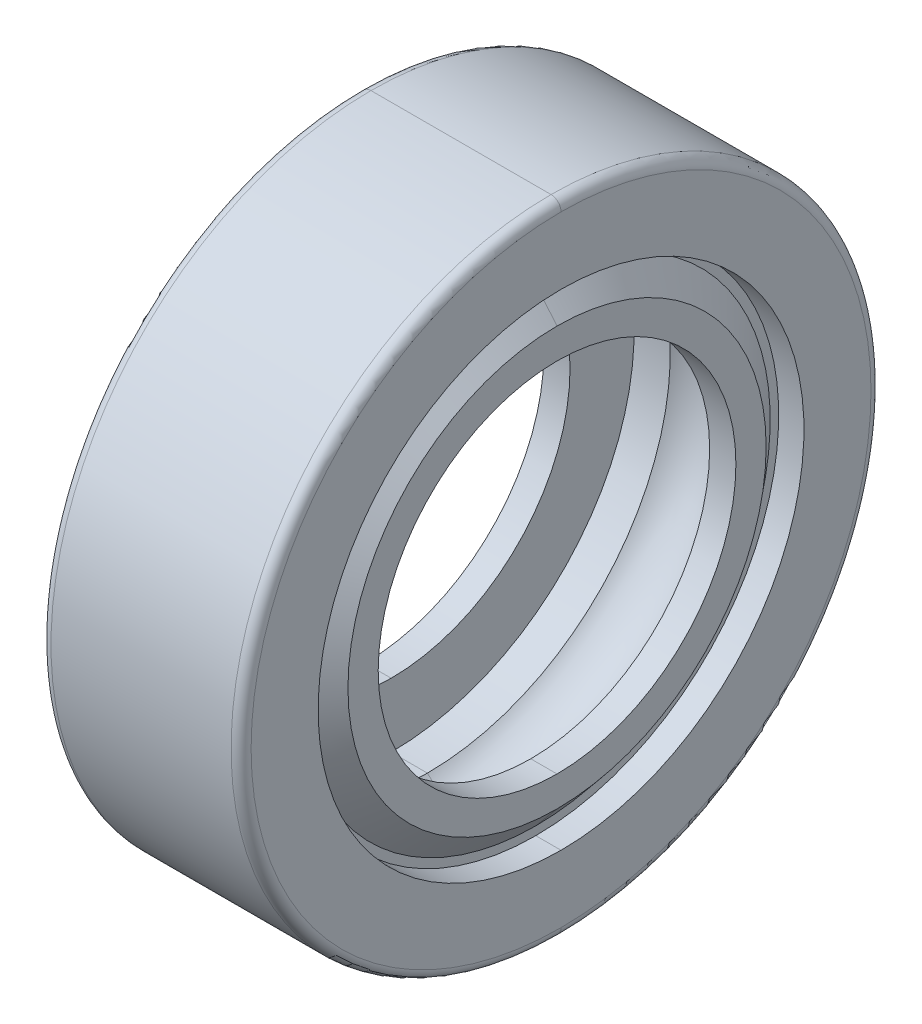
ISO-10303-21;
HEADER;
FILE_DESCRIPTION(('STEP AP214'),'2;1');
FILE_NAME('part.step','',(''),(''),'','','');
FILE_SCHEMA(('AUTOMOTIVE_DESIGN { 1 0 10303 214 1 1 1 1 }'));
ENDSEC;
DATA;
#1=APPLICATION_CONTEXT('core data for automotive mechanical design processes');
#2=APPLICATION_PROTOCOL_DEFINITION('international standard','automotive_design',2000,#1);
#3=PRODUCT_CONTEXT('',#1,'mechanical');
#4=PRODUCT('Part','Part','',(#3));
#5=PRODUCT_RELATED_PRODUCT_CATEGORY('part','',(#4));
#6=PRODUCT_DEFINITION_FORMATION('','',#4);
#7=PRODUCT_DEFINITION_CONTEXT('part definition',#1,'design');
#8=PRODUCT_DEFINITION('design','',#6,#7);
#9=PRODUCT_DEFINITION_SHAPE('','',#8);
#10=(LENGTH_UNIT() NAMED_UNIT(*) SI_UNIT(.MILLI.,.METRE.));
#11=(NAMED_UNIT(*) PLANE_ANGLE_UNIT() SI_UNIT($,.RADIAN.));
#12=(NAMED_UNIT(*) SI_UNIT($,.STERADIAN.) SOLID_ANGLE_UNIT());
#13=UNCERTAINTY_MEASURE_WITH_UNIT(LENGTH_MEASURE(1.E-05),#10,'distance_accuracy_value','');
#14=(GEOMETRIC_REPRESENTATION_CONTEXT(3) GLOBAL_UNCERTAINTY_ASSIGNED_CONTEXT((#13)) GLOBAL_UNIT_ASSIGNED_CONTEXT((#10,
#11,#12)) REPRESENTATION_CONTEXT('',''));
#15=CARTESIAN_POINT('',(0.,0.,0.));
#16=DIRECTION('',(0.,0.,1.));
#17=DIRECTION('',(1.,0.,0.));
#18=AXIS2_PLACEMENT_3D('',#15,#16,#17);
#19=CARTESIAN_POINT('',(-1.87059655427954,0.,0.));
#20=DIRECTION('',(1.,0.,0.));
#21=DIRECTION('',(0.,1.,0.));
#22=AXIS2_PLACEMENT_3D('',#19,#20,#21);
#23=PLANE('',#22);
#24=CARTESIAN_POINT('',(-1.87059655427954,0.,0.));
#25=DIRECTION('',(-1.,0.,0.));
#26=DIRECTION('',(0.,1.,0.));
#27=AXIS2_PLACEMENT_3D('',#24,#25,#26);
#28=CIRCLE('',#27,5.8619649715);
#29=CARTESIAN_POINT('',(-1.87059655427954,5.8619649715,0.));
#30=VERTEX_POINT('',#29);
#31=CARTESIAN_POINT('',(-1.87059655427954,-5.8619649715,0.));
#32=VERTEX_POINT('',#31);
#33=EDGE_CURVE('E357',#30,#32,#28,.T.);
#34=ORIENTED_EDGE('',*,*,#33,.F.);
#35=CARTESIAN_POINT('',(-1.87059655427954,0.,0.));
#36=DIRECTION('',(1.,0.,0.));
#37=DIRECTION('',(0.,1.,0.));
#38=AXIS2_PLACEMENT_3D('',#35,#36,#37);
#39=CIRCLE('',#38,5.8619649715);
#40=EDGE_CURVE('E307',#30,#32,#39,.T.);
#41=ORIENTED_EDGE('',*,*,#40,.T.);
#42=EDGE_LOOP('',(#34,#41));
#43=FACE_BOUND('',#42,.T.);
#44=CARTESIAN_POINT('',(-1.87059655427954,0.,0.));
#45=DIRECTION('',(1.,0.,0.));
#46=DIRECTION('',(0.,-1.,0.));
#47=AXIS2_PLACEMENT_3D('',#44,#45,#46);
#48=CIRCLE('',#47,6.0745751);
#49=CARTESIAN_POINT('',(-1.87059655427954,-6.0745751,0.));
#50=VERTEX_POINT('',#49);
#51=CARTESIAN_POINT('',(-1.87059655427954,6.0745751,0.));
#52=VERTEX_POINT('',#51);
#53=EDGE_CURVE('E27',#50,#52,#48,.T.);
#54=ORIENTED_EDGE('',*,*,#53,.F.);
#55=CARTESIAN_POINT('',(-1.87059655427954,0.,0.));
#56=DIRECTION('',(1.,0.,0.));
#57=DIRECTION('',(0.,1.,0.));
#58=AXIS2_PLACEMENT_3D('',#55,#56,#57);
#59=CIRCLE('',#58,6.0745751);
#60=EDGE_CURVE('E11',#52,#50,#59,.T.);
#61=ORIENTED_EDGE('',*,*,#60,.F.);
#62=EDGE_LOOP('',(#54,#61));
#63=FACE_BOUND('',#62,.T.);
#64=ADVANCED_FACE('F16',(#43,#63),#23,.F.);
#65=CARTESIAN_POINT('',(-2.75209,0.,0.));
#66=DIRECTION('',(1.,0.,0.));
#67=DIRECTION('',(0.,-1.,0.));
#68=AXIS2_PLACEMENT_3D('',#65,#66,#67);
#69=CYLINDRICAL_SURFACE('',#68,6.0745751);
#70=DIRECTION('',(1.,0.,0.));
#71=VECTOR('',#70,1.);
#72=CARTESIAN_POINT('',(-2.5019,-6.0745751,0.));
#73=LINE('',#72,#71);
#74=CARTESIAN_POINT('',(-2.5019,-6.0745751,0.));
#75=VERTEX_POINT('',#74);
#76=EDGE_CURVE('E133',#75,#50,#73,.T.);
#77=ORIENTED_EDGE('',*,*,#76,.F.);
#78=CARTESIAN_POINT('',(-2.5019,0.,0.));
#79=DIRECTION('',(1.,0.,0.));
#80=DIRECTION('',(0.,1.,0.));
#81=AXIS2_PLACEMENT_3D('',#78,#79,#80);
#82=CIRCLE('',#81,6.0745751);
#83=CARTESIAN_POINT('',(-2.5019,6.0745751,0.));
#84=VERTEX_POINT('',#83);
#85=EDGE_CURVE('E348',#84,#75,#82,.T.);
#86=ORIENTED_EDGE('',*,*,#85,.F.);
#87=DIRECTION('',(1.,0.,0.));
#88=VECTOR('',#87,1.);
#89=CARTESIAN_POINT('',(-2.5019,6.0745751,0.));
#90=LINE('',#89,#88);
#91=EDGE_CURVE('E146',#84,#52,#90,.T.);
#92=ORIENTED_EDGE('',*,*,#91,.T.);
#93=ORIENTED_EDGE('',*,*,#60,.T.);
#94=EDGE_LOOP('',(#77,#86,#92,#93));
#95=FACE_BOUND('',#94,.T.);
#96=ADVANCED_FACE('F477',(#95),#69,.F.);
#97=CARTESIAN_POINT('',(-2.75209,0.,0.));
#98=DIRECTION('',(1.,0.,0.));
#99=DIRECTION('',(0.,-1.,0.));
#100=AXIS2_PLACEMENT_3D('',#97,#98,#99);
#101=CYLINDRICAL_SURFACE('',#100,6.0745751);
#102=ORIENTED_EDGE('',*,*,#91,.F.);
#103=CARTESIAN_POINT('',(-2.5019,0.,0.));
#104=DIRECTION('',(-1.,0.,0.));
#105=DIRECTION('',(0.,1.,0.));
#106=AXIS2_PLACEMENT_3D('',#103,#104,#105);
#107=CIRCLE('',#106,6.0745751);
#108=EDGE_CURVE('E261',#84,#75,#107,.T.);
#109=ORIENTED_EDGE('',*,*,#108,.T.);
#110=ORIENTED_EDGE('',*,*,#76,.T.);
#111=ORIENTED_EDGE('',*,*,#53,.T.);
#112=EDGE_LOOP('',(#102,#109,#110,#111));
#113=FACE_BOUND('',#112,.T.);
#114=ADVANCED_FACE('F18',(#113),#101,.F.);
#115=CARTESIAN_POINT('',(-2.5019,0.,0.));
#116=DIRECTION('',(1.,0.,0.));
#117=DIRECTION('',(0.,1.,0.));
#118=AXIS2_PLACEMENT_3D('',#115,#116,#117);
#119=PLANE('',#118);
#120=ORIENTED_EDGE('',*,*,#108,.F.);
#121=ORIENTED_EDGE('',*,*,#85,.T.);
#122=EDGE_LOOP('',(#120,#121));
#123=FACE_BOUND('',#122,.T.);
#124=CARTESIAN_POINT('',(-2.5019,0.,0.));
#125=DIRECTION('',(1.,0.,0.));
#126=DIRECTION('',(0.,1.,0.));
#127=AXIS2_PLACEMENT_3D('',#124,#125,#126);
#128=CIRCLE('',#127,7.75081);
#129=CARTESIAN_POINT('',(-2.5019,7.75081,0.));
#130=VERTEX_POINT('',#129);
#131=CARTESIAN_POINT('',(-2.5019,-7.75081,0.));
#132=VERTEX_POINT('',#131);
#133=EDGE_CURVE('E256',#130,#132,#128,.T.);
#134=ORIENTED_EDGE('',*,*,#133,.F.);
#135=CARTESIAN_POINT('',(-2.5019,0.,0.));
#136=DIRECTION('',(-1.,0.,0.));
#137=DIRECTION('',(0.,1.,0.));
#138=AXIS2_PLACEMENT_3D('',#135,#136,#137);
#139=CIRCLE('',#138,7.75081);
#140=EDGE_CURVE('E258',#130,#132,#139,.T.);
#141=ORIENTED_EDGE('',*,*,#140,.T.);
#142=EDGE_LOOP('',(#134,#141));
#143=FACE_BOUND('',#142,.T.);
#144=ADVANCED_FACE('F562',(#123,#143),#119,.F.);
#145=CARTESIAN_POINT('',(-2.25171,0.,0.));
#146=DIRECTION('',(1.,0.,0.));
#147=DIRECTION('',(0.,-1.,0.));
#148=AXIS2_PLACEMENT_3D('',#145,#146,#147);
#149=TOROIDAL_SURFACE('',#148,7.75081,0.25019);
#150=CARTESIAN_POINT('',(-2.25171,0.,0.));
#151=DIRECTION('',(-1.,0.,0.));
#152=DIRECTION('',(0.,1.,0.));
#153=AXIS2_PLACEMENT_3D('',#150,#151,#152);
#154=CIRCLE('',#153,8.001);
#155=CARTESIAN_POINT('',(-2.25171,8.001,0.));
#156=VERTEX_POINT('',#155);
#157=CARTESIAN_POINT('',(-2.25171,-8.001,0.));
#158=VERTEX_POINT('',#157);
#159=EDGE_CURVE('E291',#156,#158,#154,.T.);
#160=ORIENTED_EDGE('',*,*,#159,.T.);
#161=CARTESIAN_POINT('',(-2.25171,-7.75081,0.));
#162=DIRECTION('',(0.,0.,-1.));
#163=DIRECTION('',(0.,-1.,0.));
#164=AXIS2_PLACEMENT_3D('',#161,#162,#163);
#165=CIRCLE('',#164,0.25019);
#166=EDGE_CURVE('E349',#158,#132,#165,.T.);
#167=ORIENTED_EDGE('',*,*,#166,.T.);
#168=ORIENTED_EDGE('',*,*,#140,.F.);
#169=CARTESIAN_POINT('',(-2.25171,7.75081,0.));
#170=DIRECTION('',(0.,0.,1.));
#171=DIRECTION('',(0.,1.,0.));
#172=AXIS2_PLACEMENT_3D('',#169,#170,#171);
#173=CIRCLE('',#172,0.25019);
#174=EDGE_CURVE('E262',#156,#130,#173,.T.);
#175=ORIENTED_EDGE('',*,*,#174,.F.);
#176=EDGE_LOOP('',(#160,#167,#168,#175));
#177=FACE_BOUND('',#176,.T.);
#178=ADVANCED_FACE('F531',(#177),#149,.T.);
#179=CARTESIAN_POINT('',(-2.25171,0.,0.));
#180=DIRECTION('',(1.,0.,0.));
#181=DIRECTION('',(0.,-1.,0.));
#182=AXIS2_PLACEMENT_3D('',#179,#180,#181);
#183=TOROIDAL_SURFACE('',#182,7.75081,0.25019);
#184=ORIENTED_EDGE('',*,*,#133,.T.);
#185=ORIENTED_EDGE('',*,*,#166,.F.);
#186=CARTESIAN_POINT('',(-2.25171,0.,0.));
#187=DIRECTION('',(1.,0.,0.));
#188=DIRECTION('',(0.,1.,0.));
#189=AXIS2_PLACEMENT_3D('',#186,#187,#188);
#190=CIRCLE('',#189,8.001);
#191=EDGE_CURVE('E252',#156,#158,#190,.T.);
#192=ORIENTED_EDGE('',*,*,#191,.F.);
#193=ORIENTED_EDGE('',*,*,#174,.T.);
#194=EDGE_LOOP('',(#184,#185,#192,#193));
#195=FACE_BOUND('',#194,.T.);
#196=ADVANCED_FACE('F526',(#195),#183,.T.);
#197=CARTESIAN_POINT('',(-2.75209,0.,0.));
#198=DIRECTION('',(1.,0.,0.));
#199=DIRECTION('',(0.,-1.,0.));
#200=AXIS2_PLACEMENT_3D('',#197,#198,#199);
#201=CYLINDRICAL_SURFACE('',#200,8.001);
#202=ORIENTED_EDGE('',*,*,#191,.T.);
#203=DIRECTION('',(-1.,0.,0.));
#204=VECTOR('',#203,1.);
#205=CARTESIAN_POINT('',(2.25171,-8.001,0.));
#206=LINE('',#205,#204);
#207=CARTESIAN_POINT('',(2.25171,-8.001,0.));
#208=VERTEX_POINT('',#207);
#209=EDGE_CURVE('E295',#208,#158,#206,.T.);
#210=ORIENTED_EDGE('',*,*,#209,.F.);
#211=CARTESIAN_POINT('',(2.25171,0.,0.));
#212=DIRECTION('',(1.,0.,0.));
#213=DIRECTION('',(0.,1.,0.));
#214=AXIS2_PLACEMENT_3D('',#211,#212,#213);
#215=CIRCLE('',#214,8.001);
#216=CARTESIAN_POINT('',(2.25171,8.001,0.));
#217=VERTEX_POINT('',#216);
#218=EDGE_CURVE('E274',#217,#208,#215,.T.);
#219=ORIENTED_EDGE('',*,*,#218,.F.);
#220=DIRECTION('',(-1.,0.,0.));
#221=VECTOR('',#220,1.);
#222=CARTESIAN_POINT('',(2.25171,8.001,0.));
#223=LINE('',#222,#221);
#224=EDGE_CURVE('E257',#217,#156,#223,.T.);
#225=ORIENTED_EDGE('',*,*,#224,.T.);
#226=EDGE_LOOP('',(#202,#210,#219,#225));
#227=FACE_BOUND('',#226,.T.);
#228=ADVANCED_FACE('F495',(#227),#201,.T.);
#229=CARTESIAN_POINT('',(-2.75209,0.,0.));
#230=DIRECTION('',(1.,0.,0.));
#231=DIRECTION('',(0.,-1.,0.));
#232=AXIS2_PLACEMENT_3D('',#229,#230,#231);
#233=CYLINDRICAL_SURFACE('',#232,8.001);
#234=CARTESIAN_POINT('',(2.25171,0.,0.));
#235=DIRECTION('',(-1.,0.,0.));
#236=DIRECTION('',(0.,1.,0.));
#237=AXIS2_PLACEMENT_3D('',#234,#235,#236);
#238=CIRCLE('',#237,8.001);
#239=EDGE_CURVE('E315',#217,#208,#238,.T.);
#240=ORIENTED_EDGE('',*,*,#239,.T.);
#241=ORIENTED_EDGE('',*,*,#209,.T.);
#242=ORIENTED_EDGE('',*,*,#159,.F.);
#243=ORIENTED_EDGE('',*,*,#224,.F.);
#244=EDGE_LOOP('',(#240,#241,#242,#243));
#245=FACE_BOUND('',#244,.T.);
#246=ADVANCED_FACE('F491',(#245),#233,.T.);
#247=CARTESIAN_POINT('',(2.25171,0.,0.));
#248=DIRECTION('',(1.,0.,0.));
#249=DIRECTION('',(0.,-1.,0.));
#250=AXIS2_PLACEMENT_3D('',#247,#248,#249);
#251=TOROIDAL_SURFACE('',#250,7.75081,0.25019);
#252=CARTESIAN_POINT('',(2.5019,0.,0.));
#253=DIRECTION('',(-1.,0.,0.));
#254=DIRECTION('',(0.,1.,0.));
#255=AXIS2_PLACEMENT_3D('',#252,#253,#254);
#256=CIRCLE('',#255,7.75081);
#257=CARTESIAN_POINT('',(2.5019,7.75081,0.));
#258=VERTEX_POINT('',#257);
#259=CARTESIAN_POINT('',(2.5019,-7.75081,0.));
#260=VERTEX_POINT('',#259);
#261=EDGE_CURVE('E323',#258,#260,#256,.T.);
#262=ORIENTED_EDGE('',*,*,#261,.T.);
#263=CARTESIAN_POINT('',(2.25171,-7.75081,0.));
#264=DIRECTION('',(0.,0.,-1.));
#265=DIRECTION('',(1.,0.,0.));
#266=AXIS2_PLACEMENT_3D('',#263,#264,#265);
#267=CIRCLE('',#266,0.25019);
#268=EDGE_CURVE('E278',#260,#208,#267,.T.);
#269=ORIENTED_EDGE('',*,*,#268,.T.);
#270=ORIENTED_EDGE('',*,*,#239,.F.);
#271=CARTESIAN_POINT('',(2.25171,7.75081,0.));
#272=DIRECTION('',(0.,0.,1.));
#273=DIRECTION('',(1.,0.,0.));
#274=AXIS2_PLACEMENT_3D('',#271,#272,#273);
#275=CIRCLE('',#274,0.25019);
#276=EDGE_CURVE('E336',#258,#217,#275,.T.);
#277=ORIENTED_EDGE('',*,*,#276,.F.);
#278=EDGE_LOOP('',(#262,#269,#270,#277));
#279=FACE_BOUND('',#278,.T.);
#280=ADVANCED_FACE('F494',(#279),#251,.T.);
#281=CARTESIAN_POINT('',(2.25171,0.,0.));
#282=DIRECTION('',(1.,0.,0.));
#283=DIRECTION('',(0.,-1.,0.));
#284=AXIS2_PLACEMENT_3D('',#281,#282,#283);
#285=TOROIDAL_SURFACE('',#284,7.75081,0.25019);
#286=ORIENTED_EDGE('',*,*,#218,.T.);
#287=ORIENTED_EDGE('',*,*,#268,.F.);
#288=CARTESIAN_POINT('',(2.5019,0.,0.));
#289=DIRECTION('',(1.,0.,0.));
#290=DIRECTION('',(0.,1.,0.));
#291=AXIS2_PLACEMENT_3D('',#288,#289,#290);
#292=CIRCLE('',#291,7.75081);
#293=EDGE_CURVE('E279',#258,#260,#292,.T.);
#294=ORIENTED_EDGE('',*,*,#293,.F.);
#295=ORIENTED_EDGE('',*,*,#276,.T.);
#296=EDGE_LOOP('',(#286,#287,#294,#295));
#297=FACE_BOUND('',#296,.T.);
#298=ADVANCED_FACE('F508',(#297),#285,.T.);
#299=CARTESIAN_POINT('',(2.5019,0.,0.));
#300=DIRECTION('',(1.,0.,0.));
#301=DIRECTION('',(0.,1.,0.));
#302=AXIS2_PLACEMENT_3D('',#299,#300,#301);
#303=PLANE('',#302);
#304=CARTESIAN_POINT('',(2.5019,0.,0.));
#305=DIRECTION('',(1.,0.,0.));
#306=DIRECTION('',(0.,1.,0.));
#307=AXIS2_PLACEMENT_3D('',#304,#305,#306);
#308=CIRCLE('',#307,6.0745751);
#309=CARTESIAN_POINT('',(2.5019,6.0745751,0.));
#310=VERTEX_POINT('',#309);
#311=CARTESIAN_POINT('',(2.5019,-6.0745751,0.));
#312=VERTEX_POINT('',#311);
#313=EDGE_CURVE('E288',#310,#312,#308,.T.);
#314=ORIENTED_EDGE('',*,*,#313,.F.);
#315=CARTESIAN_POINT('',(2.5019,0.,0.));
#316=DIRECTION('',(-1.,0.,0.));
#317=DIRECTION('',(0.,1.,0.));
#318=AXIS2_PLACEMENT_3D('',#315,#316,#317);
#319=CIRCLE('',#318,6.0745751);
#320=EDGE_CURVE('E250',#310,#312,#319,.T.);
#321=ORIENTED_EDGE('',*,*,#320,.T.);
#322=EDGE_LOOP('',(#314,#321));
#323=FACE_BOUND('',#322,.T.);
#324=ORIENTED_EDGE('',*,*,#261,.F.);
#325=ORIENTED_EDGE('',*,*,#293,.T.);
#326=EDGE_LOOP('',(#324,#325));
#327=FACE_BOUND('',#326,.T.);
#328=ADVANCED_FACE('F512',(#323,#327),#303,.T.);
#329=CARTESIAN_POINT('',(-2.75209,0.,0.));
#330=DIRECTION('',(1.,0.,0.));
#331=DIRECTION('',(0.,-1.,0.));
#332=AXIS2_PLACEMENT_3D('',#329,#330,#331);
#333=CYLINDRICAL_SURFACE('',#332,6.0745751);
#334=DIRECTION('',(1.,0.,0.));
#335=VECTOR('',#334,1.);
#336=CARTESIAN_POINT('',(1.87059655427954,-6.0745751,0.));
#337=LINE('',#336,#335);
#338=CARTESIAN_POINT('',(1.87059655427954,-6.0745751,0.));
#339=VERTEX_POINT('',#338);
#340=EDGE_CURVE('E386',#339,#312,#337,.T.);
#341=ORIENTED_EDGE('',*,*,#340,.T.);
#342=ORIENTED_EDGE('',*,*,#320,.F.);
#343=DIRECTION('',(1.,0.,0.));
#344=VECTOR('',#343,1.);
#345=CARTESIAN_POINT('',(1.87059655427954,6.0745751,0.));
#346=LINE('',#345,#344);
#347=CARTESIAN_POINT('',(1.87059655427954,6.0745751,0.));
#348=VERTEX_POINT('',#347);
#349=EDGE_CURVE('E285',#348,#310,#346,.T.);
#350=ORIENTED_EDGE('',*,*,#349,.F.);
#351=CARTESIAN_POINT('',(1.87059655427954,0.,0.));
#352=DIRECTION('',(1.,0.,0.));
#353=DIRECTION('',(0.,-1.,0.));
#354=AXIS2_PLACEMENT_3D('',#351,#352,#353);
#355=CIRCLE('',#354,6.0745751);
#356=EDGE_CURVE('E247',#339,#348,#355,.T.);
#357=ORIENTED_EDGE('',*,*,#356,.F.);
#358=EDGE_LOOP('',(#341,#342,#350,#357));
#359=FACE_BOUND('',#358,.T.);
#360=ADVANCED_FACE('F590',(#359),#333,.F.);
#361=CARTESIAN_POINT('',(1.87059655427954,0.,0.));
#362=DIRECTION('',(1.,0.,0.));
#363=DIRECTION('',(0.,1.,0.));
#364=AXIS2_PLACEMENT_3D('',#361,#362,#363);
#365=PLANE('',#364);
#366=CARTESIAN_POINT('',(1.87059655427954,0.,0.));
#367=DIRECTION('',(1.,0.,0.));
#368=DIRECTION('',(0.,1.,0.));
#369=AXIS2_PLACEMENT_3D('',#366,#367,#368);
#370=CIRCLE('',#369,5.8619649715);
#371=CARTESIAN_POINT('',(1.87059655427954,5.8619649715,0.));
#372=VERTEX_POINT('',#371);
#373=CARTESIAN_POINT('',(1.87059655427954,-5.8619649715,0.));
#374=VERTEX_POINT('',#373);
#375=EDGE_CURVE('E20',#372,#374,#370,.T.);
#376=ORIENTED_EDGE('',*,*,#375,.F.);
#377=CARTESIAN_POINT('',(1.87059655427954,0.,0.));
#378=DIRECTION('',(-1.,0.,0.));
#379=DIRECTION('',(0.,1.,0.));
#380=AXIS2_PLACEMENT_3D('',#377,#378,#379);
#381=CIRCLE('',#380,5.8619649715);
#382=EDGE_CURVE('E289',#372,#374,#381,.T.);
#383=ORIENTED_EDGE('',*,*,#382,.T.);
#384=EDGE_LOOP('',(#376,#383));
#385=FACE_BOUND('',#384,.T.);
#386=ORIENTED_EDGE('',*,*,#356,.T.);
#387=CARTESIAN_POINT('',(1.87059655427954,0.,0.));
#388=DIRECTION('',(1.,0.,0.));
#389=DIRECTION('',(0.,1.,0.));
#390=AXIS2_PLACEMENT_3D('',#387,#388,#389);
#391=CIRCLE('',#390,6.0745751);
#392=EDGE_CURVE('E251',#348,#339,#391,.T.);
#393=ORIENTED_EDGE('',*,*,#392,.T.);
#394=EDGE_LOOP('',(#386,#393));
#395=FACE_BOUND('',#394,.T.);
#396=ADVANCED_FACE('F450',(#385,#395),#365,.T.);
#397=CARTESIAN_POINT('',(-2.75209,0.,0.));
#398=DIRECTION('',(1.,0.,0.));
#399=DIRECTION('',(0.,-1.,0.));
#400=AXIS2_PLACEMENT_3D('',#397,#398,#399);
#401=CYLINDRICAL_SURFACE('',#400,6.0745751);
#402=ORIENTED_EDGE('',*,*,#349,.T.);
#403=ORIENTED_EDGE('',*,*,#313,.T.);
#404=ORIENTED_EDGE('',*,*,#340,.F.);
#405=ORIENTED_EDGE('',*,*,#392,.F.);
#406=EDGE_LOOP('',(#402,#403,#404,#405));
#407=FACE_BOUND('',#406,.T.);
#408=ADVANCED_FACE('F490',(#407),#401,.F.);
#409=CARTESIAN_POINT('',(2.41970134453178,0.,0.));
#410=DIRECTION('',(-1.,0.,0.));
#411=DIRECTION('',(0.,1.,0.));
#412=AXIS2_PLACEMENT_3D('',#409,#410,#411);
#413=CONICAL_SURFACE('',#412,5.20756736500621,0.872664625997165);
#414=CARTESIAN_POINT('',(2.401824,0.,0.));
#415=DIRECTION('',(-1.,0.,0.));
#416=DIRECTION('',(0.,1.,0.));
#417=AXIS2_PLACEMENT_3D('',#414,#415,#416);
#418=CIRCLE('',#417,5.228872754578);
#419=CARTESIAN_POINT('',(2.401824,5.228872754578,0.));
#420=VERTEX_POINT('',#419);
#421=CARTESIAN_POINT('',(2.401824,-5.228872754578,0.));
#422=VERTEX_POINT('',#421);
#423=EDGE_CURVE('E224',#420,#422,#418,.T.);
#424=ORIENTED_EDGE('',*,*,#423,.T.);
#425=DIRECTION('',(-0.642787609686539,-0.766044443118978,0.));
#426=VECTOR('',#425,1.);
#427=CARTESIAN_POINT('',(2.401824,-5.228872754578,0.));
#428=LINE('',#427,#426);
#429=EDGE_CURVE('E317',#422,#374,#428,.T.);
#430=ORIENTED_EDGE('',*,*,#429,.T.);
#431=ORIENTED_EDGE('',*,*,#382,.F.);
#432=DIRECTION('',(-0.642787609686539,0.766044443118978,0.));
#433=VECTOR('',#432,1.);
#434=CARTESIAN_POINT('',(2.401824,5.228872754578,0.));
#435=LINE('',#434,#433);
#436=EDGE_CURVE('E321',#420,#372,#435,.T.);
#437=ORIENTED_EDGE('',*,*,#436,.F.);
#438=EDGE_LOOP('',(#424,#430,#431,#437));
#439=FACE_BOUND('',#438,.T.);
#440=ADVANCED_FACE('F454',(#439),#413,.T.);
#441=CARTESIAN_POINT('',(2.41970134453178,0.,0.));
#442=DIRECTION('',(-1.,0.,0.));
#443=DIRECTION('',(0.,1.,0.));
#444=AXIS2_PLACEMENT_3D('',#441,#442,#443);
#445=CONICAL_SURFACE('',#444,5.20756736500621,0.872664625997165);
#446=ORIENTED_EDGE('',*,*,#375,.T.);
#447=ORIENTED_EDGE('',*,*,#429,.F.);
#448=CARTESIAN_POINT('',(2.401824,0.,0.));
#449=DIRECTION('',(1.,0.,0.));
#450=DIRECTION('',(0.,1.,0.));
#451=AXIS2_PLACEMENT_3D('',#448,#449,#450);
#452=CIRCLE('',#451,5.228872754578);
#453=EDGE_CURVE('E404',#420,#422,#452,.T.);
#454=ORIENTED_EDGE('',*,*,#453,.F.);
#455=ORIENTED_EDGE('',*,*,#436,.T.);
#456=EDGE_LOOP('',(#446,#447,#454,#455));
#457=FACE_BOUND('',#456,.T.);
#458=ADVANCED_FACE('F459',(#457),#445,.T.);
#459=CARTESIAN_POINT('',(2.401824,0.,0.));
#460=DIRECTION('',(1.,0.,0.));
#461=DIRECTION('',(0.,1.,0.));
#462=AXIS2_PLACEMENT_3D('',#459,#460,#461);
#463=PLANE('',#462);
#464=CARTESIAN_POINT('',(2.401824,0.,0.));
#465=DIRECTION('',(1.,0.,0.));
#466=DIRECTION('',(0.,1.,0.));
#467=AXIS2_PLACEMENT_3D('',#464,#465,#466);
#468=CIRCLE('',#467,4.472608149);
#469=CARTESIAN_POINT('',(2.401824,4.472608149,0.));
#470=VERTEX_POINT('',#469);
#471=CARTESIAN_POINT('',(2.401824,-4.472608149,0.));
#472=VERTEX_POINT('',#471);
#473=EDGE_CURVE('E222',#470,#472,#468,.T.);
#474=ORIENTED_EDGE('',*,*,#473,.F.);
#475=CARTESIAN_POINT('',(2.401824,0.,0.));
#476=DIRECTION('',(-1.,0.,0.));
#477=DIRECTION('',(0.,1.,0.));
#478=AXIS2_PLACEMENT_3D('',#475,#476,#477);
#479=CIRCLE('',#478,4.472608149);
#480=EDGE_CURVE('E217',#470,#472,#479,.T.);
#481=ORIENTED_EDGE('',*,*,#480,.T.);
#482=EDGE_LOOP('',(#474,#481));
#483=FACE_BOUND('',#482,.T.);
#484=ORIENTED_EDGE('',*,*,#423,.F.);
#485=ORIENTED_EDGE('',*,*,#453,.T.);
#486=EDGE_LOOP('',(#484,#485));
#487=FACE_BOUND('',#486,.T.);
#488=ADVANCED_FACE('F219',(#483,#487),#463,.T.);
#489=CARTESIAN_POINT('',(-2.6420064,0.,0.));
#490=DIRECTION('',(1.,0.,0.));
#491=DIRECTION('',(0.,-1.,0.));
#492=AXIS2_PLACEMENT_3D('',#489,#490,#491);
#493=CYLINDRICAL_SURFACE('',#492,4.472608149);
#494=CARTESIAN_POINT('',(1.74550155427954,0.,0.));
#495=DIRECTION('',(-1.,0.,0.));
#496=DIRECTION('',(0.,1.,0.));
#497=AXIS2_PLACEMENT_3D('',#494,#495,#496);
#498=CIRCLE('',#497,4.472608149);
#499=CARTESIAN_POINT('',(1.74550155427954,4.472608149,0.));
#500=VERTEX_POINT('',#499);
#501=CARTESIAN_POINT('',(1.74550155427954,-4.472608149,0.));
#502=VERTEX_POINT('',#501);
#503=EDGE_CURVE('E229',#500,#502,#498,.T.);
#504=ORIENTED_EDGE('',*,*,#503,.T.);
#505=DIRECTION('',(1.,0.,0.));
#506=VECTOR('',#505,1.);
#507=CARTESIAN_POINT('',(1.74550155427954,-4.472608149,0.));
#508=LINE('',#507,#506);
#509=EDGE_CURVE('E226',#502,#472,#508,.T.);
#510=ORIENTED_EDGE('',*,*,#509,.T.);
#511=ORIENTED_EDGE('',*,*,#480,.F.);
#512=DIRECTION('',(1.,0.,0.));
#513=VECTOR('',#512,1.);
#514=CARTESIAN_POINT('',(1.74550155427954,4.472608149,0.));
#515=LINE('',#514,#513);
#516=EDGE_CURVE('E103',#500,#470,#515,.T.);
#517=ORIENTED_EDGE('',*,*,#516,.F.);
#518=EDGE_LOOP('',(#504,#510,#511,#517));
#519=FACE_BOUND('',#518,.T.);
#520=ADVANCED_FACE('F227',(#519),#493,.F.);
#521=CARTESIAN_POINT('',(-2.6420064,0.,0.));
#522=DIRECTION('',(1.,0.,0.));
#523=DIRECTION('',(0.,-1.,0.));
#524=AXIS2_PLACEMENT_3D('',#521,#522,#523);
#525=CYLINDRICAL_SURFACE('',#524,4.472608149);
#526=ORIENTED_EDGE('',*,*,#473,.T.);
#527=ORIENTED_EDGE('',*,*,#509,.F.);
#528=CARTESIAN_POINT('',(1.74550155427954,0.,0.));
#529=DIRECTION('',(1.,0.,0.));
#530=DIRECTION('',(0.,1.,0.));
#531=AXIS2_PLACEMENT_3D('',#528,#529,#530);
#532=CIRCLE('',#531,4.472608149);
#533=EDGE_CURVE('E236',#500,#502,#532,.T.);
#534=ORIENTED_EDGE('',*,*,#533,.F.);
#535=ORIENTED_EDGE('',*,*,#516,.T.);
#536=EDGE_LOOP('',(#526,#527,#534,#535));
#537=FACE_BOUND('',#536,.T.);
#538=ADVANCED_FACE('F234',(#537),#525,.F.);
#539=CARTESIAN_POINT('',(1.74550155427954,0.,0.));
#540=DIRECTION('',(1.,0.,0.));
#541=DIRECTION('',(0.,1.,0.));
#542=AXIS2_PLACEMENT_3D('',#539,#540,#541);
#543=PLANE('',#542);
#544=ORIENTED_EDGE('',*,*,#503,.F.);
#545=ORIENTED_EDGE('',*,*,#533,.T.);
#546=EDGE_LOOP('',(#544,#545));
#547=FACE_BOUND('',#546,.T.);
#548=CARTESIAN_POINT('',(1.74550155427955,0.,0.));
#549=DIRECTION('',(1.,0.,0.));
#550=DIRECTION('',(0.,-1.,0.));
#551=AXIS2_PLACEMENT_3D('',#548,#549,#550);
#552=CIRCLE('',#551,6.0745751);
#553=CARTESIAN_POINT('',(1.74550155427954,-6.0745751,0.));
#554=VERTEX_POINT('',#553);
#555=CARTESIAN_POINT('',(1.74550155427954,6.0745751,0.));
#556=VERTEX_POINT('',#555);
#557=EDGE_CURVE('E301',#554,#556,#552,.T.);
#558=ORIENTED_EDGE('',*,*,#557,.F.);
#559=CARTESIAN_POINT('',(1.74550155427955,0.,0.));
#560=DIRECTION('',(1.,0.,0.));
#561=DIRECTION('',(0.,1.,0.));
#562=AXIS2_PLACEMENT_3D('',#559,#560,#561);
#563=CIRCLE('',#562,6.0745751);
#564=EDGE_CURVE('E90',#556,#554,#563,.T.);
#565=ORIENTED_EDGE('',*,*,#564,.F.);
#566=EDGE_LOOP('',(#558,#565));
#567=FACE_BOUND('',#566,.T.);
#568=ADVANCED_FACE('F595',(#547,#567),#543,.F.);
#569=CARTESIAN_POINT('',(-2.75209,0.,0.));
#570=DIRECTION('',(1.,0.,0.));
#571=DIRECTION('',(0.,-1.,0.));
#572=AXIS2_PLACEMENT_3D('',#569,#570,#571);
#573=CYLINDRICAL_SURFACE('',#572,6.0745751);
#574=DIRECTION('',(1.,0.,0.));
#575=VECTOR('',#574,1.);
#576=CARTESIAN_POINT('',(0.839755569912454,-6.0745751,0.));
#577=LINE('',#576,#575);
#578=CARTESIAN_POINT('',(0.839755569912454,-6.0745751,0.));
#579=VERTEX_POINT('',#578);
#580=EDGE_CURVE('E299',#579,#554,#577,.T.);
#581=ORIENTED_EDGE('',*,*,#580,.F.);
#582=CARTESIAN_POINT('',(0.839755569912455,0.,0.));
#583=DIRECTION('',(1.,0.,0.));
#584=DIRECTION('',(0.,1.,0.));
#585=AXIS2_PLACEMENT_3D('',#582,#583,#584);
#586=CIRCLE('',#585,6.0745751);
#587=CARTESIAN_POINT('',(0.839755569912454,6.0745751,0.));
#588=VERTEX_POINT('',#587);
#589=EDGE_CURVE('E280',#588,#579,#586,.T.);
#590=ORIENTED_EDGE('',*,*,#589,.F.);
#591=DIRECTION('',(1.,0.,0.));
#592=VECTOR('',#591,1.);
#593=CARTESIAN_POINT('',(0.839755569912454,6.0745751,0.));
#594=LINE('',#593,#592);
#595=EDGE_CURVE('E296',#588,#556,#594,.T.);
#596=ORIENTED_EDGE('',*,*,#595,.T.);
#597=ORIENTED_EDGE('',*,*,#564,.T.);
#598=EDGE_LOOP('',(#581,#590,#596,#597));
#599=FACE_BOUND('',#598,.T.);
#600=ADVANCED_FACE('F583',(#599),#573,.F.);
#601=CARTESIAN_POINT('',(-2.75209,0.,0.));
#602=DIRECTION('',(1.,0.,0.));
#603=DIRECTION('',(0.,-1.,0.));
#604=AXIS2_PLACEMENT_3D('',#601,#602,#603);
#605=CYLINDRICAL_SURFACE('',#604,6.0745751);
#606=ORIENTED_EDGE('',*,*,#595,.F.);
#607=CARTESIAN_POINT('',(0.839755569912455,0.,0.));
#608=DIRECTION('',(-1.,0.,0.));
#609=DIRECTION('',(0.,1.,0.));
#610=AXIS2_PLACEMENT_3D('',#607,#608,#609);
#611=CIRCLE('',#610,6.0745751);
#612=EDGE_CURVE('E300',#588,#579,#611,.T.);
#613=ORIENTED_EDGE('',*,*,#612,.T.);
#614=ORIENTED_EDGE('',*,*,#580,.T.);
#615=ORIENTED_EDGE('',*,*,#557,.T.);
#616=EDGE_LOOP('',(#606,#613,#614,#615));
#617=FACE_BOUND('',#616,.T.);
#618=ADVANCED_FACE('F576',(#617),#605,.F.);
#619=CARTESIAN_POINT('',(0.,0.,0.));
#620=DIRECTION('',(1.,0.,0.));
#621=DIRECTION('',(0.,-1.,0.));
#622=AXIS2_PLACEMENT_3D('',#619,#620,#621);
#623=TOROIDAL_SURFACE('',#622,5.25145,1.175893);
#624=CARTESIAN_POINT('',(-0.839755569912454,0.,0.));
#625=DIRECTION('',(-1.,0.,0.));
#626=DIRECTION('',(0.,1.,0.));
#627=AXIS2_PLACEMENT_3D('',#624,#625,#626);
#628=CIRCLE('',#627,6.0745751);
#629=CARTESIAN_POINT('',(-0.839755569912454,6.0745751,0.));
#630=VERTEX_POINT('',#629);
#631=CARTESIAN_POINT('',(-0.839755569912454,-6.0745751,0.));
#632=VERTEX_POINT('',#631);
#633=EDGE_CURVE('E329',#630,#632,#628,.T.);
#634=ORIENTED_EDGE('',*,*,#633,.T.);
#635=CARTESIAN_POINT('',(0.,-5.25145,0.));
#636=DIRECTION('',(0.,0.,1.));
#637=DIRECTION('',(-0.714142842854285,-0.7,0.));
#638=AXIS2_PLACEMENT_3D('',#635,#636,#637);
#639=CIRCLE('',#638,1.175893);
#640=EDGE_CURVE('E284',#632,#579,#639,.T.);
#641=ORIENTED_EDGE('',*,*,#640,.T.);
#642=ORIENTED_EDGE('',*,*,#612,.F.);
#643=CARTESIAN_POINT('',(0.,5.25145,0.));
#644=DIRECTION('',(0.,0.,-1.));
#645=DIRECTION('',(-0.714142842854285,0.7,0.));
#646=AXIS2_PLACEMENT_3D('',#643,#644,#645);
#647=CIRCLE('',#646,1.175893);
#648=EDGE_CURVE('E245',#630,#588,#647,.T.);
#649=ORIENTED_EDGE('',*,*,#648,.F.);
#650=EDGE_LOOP('',(#634,#641,#642,#649));
#651=FACE_BOUND('',#650,.T.);
#652=ADVANCED_FACE('F572',(#651),#623,.F.);
#653=CARTESIAN_POINT('',(0.,0.,0.));
#654=DIRECTION('',(1.,0.,0.));
#655=DIRECTION('',(0.,-1.,0.));
#656=AXIS2_PLACEMENT_3D('',#653,#654,#655);
#657=TOROIDAL_SURFACE('',#656,5.25145,1.175893);
#658=ORIENTED_EDGE('',*,*,#589,.T.);
#659=ORIENTED_EDGE('',*,*,#640,.F.);
#660=CARTESIAN_POINT('',(-0.839755569912454,0.,0.));
#661=DIRECTION('',(1.,0.,0.));
#662=DIRECTION('',(0.,1.,0.));
#663=AXIS2_PLACEMENT_3D('',#660,#661,#662);
#664=CIRCLE('',#663,6.0745751);
#665=EDGE_CURVE('E272',#630,#632,#664,.T.);
#666=ORIENTED_EDGE('',*,*,#665,.F.);
#667=ORIENTED_EDGE('',*,*,#648,.T.);
#668=EDGE_LOOP('',(#658,#659,#666,#667));
#669=FACE_BOUND('',#668,.T.);
#670=ADVANCED_FACE('F575',(#669),#657,.F.);
#671=CARTESIAN_POINT('',(-2.75209,0.,0.));
#672=DIRECTION('',(1.,0.,0.));
#673=DIRECTION('',(0.,-1.,0.));
#674=AXIS2_PLACEMENT_3D('',#671,#672,#673);
#675=CYLINDRICAL_SURFACE('',#674,6.0745751);
#676=DIRECTION('',(1.,0.,0.));
#677=VECTOR('',#676,1.);
#678=CARTESIAN_POINT('',(-1.74550155427954,6.0745751,0.));
#679=LINE('',#678,#677);
#680=CARTESIAN_POINT('',(-1.74550155427954,6.0745751,0.));
#681=VERTEX_POINT('',#680);
#682=EDGE_CURVE('E325',#681,#630,#679,.T.);
#683=ORIENTED_EDGE('',*,*,#682,.T.);
#684=ORIENTED_EDGE('',*,*,#665,.T.);
#685=DIRECTION('',(1.,0.,0.));
#686=VECTOR('',#685,1.);
#687=CARTESIAN_POINT('',(-1.74550155427954,-6.0745751,0.));
#688=LINE('',#687,#686);
#689=CARTESIAN_POINT('',(-1.74550155427954,-6.0745751,0.));
#690=VERTEX_POINT('',#689);
#691=EDGE_CURVE('E432',#690,#632,#688,.T.);
#692=ORIENTED_EDGE('',*,*,#691,.F.);
#693=CARTESIAN_POINT('',(-1.74550155427954,0.,0.));
#694=DIRECTION('',(1.,0.,0.));
#695=DIRECTION('',(0.,1.,0.));
#696=AXIS2_PLACEMENT_3D('',#693,#694,#695);
#697=CIRCLE('',#696,6.0745751);
#698=EDGE_CURVE('E269',#681,#690,#697,.T.);
#699=ORIENTED_EDGE('',*,*,#698,.F.);
#700=EDGE_LOOP('',(#683,#684,#692,#699));
#701=FACE_BOUND('',#700,.T.);
#702=ADVANCED_FACE('F486',(#701),#675,.F.);
#703=CARTESIAN_POINT('',(-1.74550155427954,0.,0.));
#704=DIRECTION('',(1.,0.,0.));
#705=DIRECTION('',(0.,1.,0.));
#706=AXIS2_PLACEMENT_3D('',#703,#704,#705);
#707=PLANE('',#706);
#708=CARTESIAN_POINT('',(-1.74550155427954,0.,0.));
#709=DIRECTION('',(1.,0.,0.));
#710=DIRECTION('',(0.,1.,0.));
#711=AXIS2_PLACEMENT_3D('',#708,#709,#710);
#712=CIRCLE('',#711,4.472608149);
#713=CARTESIAN_POINT('',(-1.74550155427954,4.472608149,0.));
#714=VERTEX_POINT('',#713);
#715=CARTESIAN_POINT('',(-1.74550155427954,-4.472608149,0.));
#716=VERTEX_POINT('',#715);
#717=EDGE_CURVE('E263',#714,#716,#712,.T.);
#718=ORIENTED_EDGE('',*,*,#717,.F.);
#719=CARTESIAN_POINT('',(-1.74550155427954,0.,0.));
#720=DIRECTION('',(-1.,0.,0.));
#721=DIRECTION('',(0.,1.,0.));
#722=AXIS2_PLACEMENT_3D('',#719,#720,#721);
#723=CIRCLE('',#722,4.472608149);
#724=EDGE_CURVE('E429',#714,#716,#723,.T.);
#725=ORIENTED_EDGE('',*,*,#724,.T.);
#726=EDGE_LOOP('',(#718,#725));
#727=FACE_BOUND('',#726,.T.);
#728=CARTESIAN_POINT('',(-1.74550155427954,0.,0.));
#729=DIRECTION('',(1.,0.,0.));
#730=DIRECTION('',(0.,-1.,0.));
#731=AXIS2_PLACEMENT_3D('',#728,#729,#730);
#732=CIRCLE('',#731,6.0745751);
#733=EDGE_CURVE('E273',#690,#681,#732,.T.);
#734=ORIENTED_EDGE('',*,*,#733,.T.);
#735=ORIENTED_EDGE('',*,*,#698,.T.);
#736=EDGE_LOOP('',(#734,#735));
#737=FACE_BOUND('',#736,.T.);
#738=ADVANCED_FACE('F518',(#727,#737),#707,.T.);
#739=CARTESIAN_POINT('',(-2.75209,0.,0.));
#740=DIRECTION('',(1.,0.,0.));
#741=DIRECTION('',(0.,-1.,0.));
#742=AXIS2_PLACEMENT_3D('',#739,#740,#741);
#743=CYLINDRICAL_SURFACE('',#742,6.0745751);
#744=ORIENTED_EDGE('',*,*,#691,.T.);
#745=ORIENTED_EDGE('',*,*,#633,.F.);
#746=ORIENTED_EDGE('',*,*,#682,.F.);
#747=ORIENTED_EDGE('',*,*,#733,.F.);
#748=EDGE_LOOP('',(#744,#745,#746,#747));
#749=FACE_BOUND('',#748,.T.);
#750=ADVANCED_FACE('F500',(#749),#743,.F.);
#751=CARTESIAN_POINT('',(-2.6420064,0.,0.));
#752=DIRECTION('',(1.,0.,0.));
#753=DIRECTION('',(0.,-1.,0.));
#754=AXIS2_PLACEMENT_3D('',#751,#752,#753);
#755=CYLINDRICAL_SURFACE('',#754,4.472608149);
#756=CARTESIAN_POINT('',(-2.401824,0.,0.));
#757=DIRECTION('',(-1.,0.,0.));
#758=DIRECTION('',(0.,1.,0.));
#759=AXIS2_PLACEMENT_3D('',#756,#757,#758);
#760=CIRCLE('',#759,4.472608149);
#761=CARTESIAN_POINT('',(-2.401824,4.472608149,0.));
#762=VERTEX_POINT('',#761);
#763=CARTESIAN_POINT('',(-2.401824,-4.472608149,0.));
#764=VERTEX_POINT('',#763);
#765=EDGE_CURVE('E356',#762,#764,#760,.T.);
#766=ORIENTED_EDGE('',*,*,#765,.T.);
#767=DIRECTION('',(1.,0.,0.));
#768=VECTOR('',#767,1.);
#769=CARTESIAN_POINT('',(-2.401824,-4.472608149,0.));
#770=LINE('',#769,#768);
#771=EDGE_CURVE('E267',#764,#716,#770,.T.);
#772=ORIENTED_EDGE('',*,*,#771,.T.);
#773=ORIENTED_EDGE('',*,*,#724,.F.);
#774=DIRECTION('',(1.,0.,0.));
#775=VECTOR('',#774,1.);
#776=CARTESIAN_POINT('',(-2.401824,4.472608149,0.));
#777=LINE('',#776,#775);
#778=EDGE_CURVE('E433',#762,#714,#777,.T.);
#779=ORIENTED_EDGE('',*,*,#778,.F.);
#780=EDGE_LOOP('',(#766,#772,#773,#779));
#781=FACE_BOUND('',#780,.T.);
#782=ADVANCED_FACE('F497',(#781),#755,.F.);
#783=CARTESIAN_POINT('',(-2.6420064,0.,0.));
#784=DIRECTION('',(1.,0.,0.));
#785=DIRECTION('',(0.,-1.,0.));
#786=AXIS2_PLACEMENT_3D('',#783,#784,#785);
#787=CYLINDRICAL_SURFACE('',#786,4.472608149);
#788=ORIENTED_EDGE('',*,*,#717,.T.);
#789=ORIENTED_EDGE('',*,*,#771,.F.);
#790=CARTESIAN_POINT('',(-2.401824,0.,0.));
#791=DIRECTION('',(1.,0.,0.));
#792=DIRECTION('',(0.,1.,0.));
#793=AXIS2_PLACEMENT_3D('',#790,#791,#792);
#794=CIRCLE('',#793,4.472608149);
#795=EDGE_CURVE('E268',#762,#764,#794,.T.);
#796=ORIENTED_EDGE('',*,*,#795,.F.);
#797=ORIENTED_EDGE('',*,*,#778,.T.);
#798=EDGE_LOOP('',(#788,#789,#796,#797));
#799=FACE_BOUND('',#798,.T.);
#800=ADVANCED_FACE('F499',(#799),#787,.F.);
#801=CARTESIAN_POINT('',(-2.401824,0.,0.));
#802=DIRECTION('',(1.,0.,0.));
#803=DIRECTION('',(0.,1.,0.));
#804=AXIS2_PLACEMENT_3D('',#801,#802,#803);
#805=PLANE('',#804);
#806=ORIENTED_EDGE('',*,*,#765,.F.);
#807=ORIENTED_EDGE('',*,*,#795,.T.);
#808=EDGE_LOOP('',(#806,#807));
#809=FACE_BOUND('',#808,.T.);
#810=CARTESIAN_POINT('',(-2.401824,0.,0.));
#811=DIRECTION('',(1.,0.,0.));
#812=DIRECTION('',(0.,1.,0.));
#813=AXIS2_PLACEMENT_3D('',#810,#811,#812);
#814=CIRCLE('',#813,5.228872754578);
#815=CARTESIAN_POINT('',(-2.401824,5.228872754578,0.));
#816=VERTEX_POINT('',#815);
#817=CARTESIAN_POINT('',(-2.401824,-5.228872754578,0.));
#818=VERTEX_POINT('',#817);
#819=EDGE_CURVE('E439',#816,#818,#814,.T.);
#820=ORIENTED_EDGE('',*,*,#819,.F.);
#821=CARTESIAN_POINT('',(-2.401824,0.,0.));
#822=DIRECTION('',(-1.,0.,0.));
#823=DIRECTION('',(0.,1.,0.));
#824=AXIS2_PLACEMENT_3D('',#821,#822,#823);
#825=CIRCLE('',#824,5.228872754578);
#826=EDGE_CURVE('E353',#816,#818,#825,.T.);
#827=ORIENTED_EDGE('',*,*,#826,.T.);
#828=EDGE_LOOP('',(#820,#827));
#829=FACE_BOUND('',#828,.T.);
#830=ADVANCED_FACE('F516',(#809,#829),#805,.F.);
#831=CARTESIAN_POINT('',(-2.41970134453178,0.,0.));
#832=DIRECTION('',(1.,0.,0.));
#833=DIRECTION('',(0.,-1.,0.));
#834=AXIS2_PLACEMENT_3D('',#831,#832,#833);
#835=CONICAL_SURFACE('',#834,5.20756736500621,0.872664625997165);
#836=ORIENTED_EDGE('',*,*,#33,.T.);
#837=DIRECTION('',(-0.642787609686539,0.766044443118978,0.));
#838=VECTOR('',#837,1.);
#839=CARTESIAN_POINT('',(-1.87059655427954,-5.8619649715,0.));
#840=LINE('',#839,#838);
#841=EDGE_CURVE('E312',#32,#818,#840,.T.);
#842=ORIENTED_EDGE('',*,*,#841,.T.);
#843=ORIENTED_EDGE('',*,*,#826,.F.);
#844=DIRECTION('',(-0.642787609686539,-0.766044443118978,0.));
#845=VECTOR('',#844,1.);
#846=CARTESIAN_POINT('',(-1.87059655427954,5.8619649715,0.));
#847=LINE('',#846,#845);
#848=EDGE_CURVE('E311',#30,#816,#847,.T.);
#849=ORIENTED_EDGE('',*,*,#848,.F.);
#850=EDGE_LOOP('',(#836,#842,#843,#849));
#851=FACE_BOUND('',#850,.T.);
#852=ADVANCED_FACE('F523',(#851),#835,.T.);
#853=CARTESIAN_POINT('',(-2.41970134453178,0.,0.));
#854=DIRECTION('',(1.,0.,0.));
#855=DIRECTION('',(0.,-1.,0.));
#856=AXIS2_PLACEMENT_3D('',#853,#854,#855);
#857=CONICAL_SURFACE('',#856,5.20756736500621,0.872664625997165);
#858=ORIENTED_EDGE('',*,*,#819,.T.);
#859=ORIENTED_EDGE('',*,*,#841,.F.);
#860=ORIENTED_EDGE('',*,*,#40,.F.);
#861=ORIENTED_EDGE('',*,*,#848,.T.);
#862=EDGE_LOOP('',(#858,#859,#860,#861));
#863=FACE_BOUND('',#862,.T.);
#864=ADVANCED_FACE('F597',(#863),#857,.T.);
#865=CLOSED_SHELL('',(#64,#96,#114,#144,#178,#196,#228,#246,#280,#298,#328,#360,#396,#408,#440,
#458,#488,#520,#538,#568,#600,#618,#652,#670,#702,#738,#750,#782,#800,#830,#852,#864));
#866=MANIFOLD_SOLID_BREP('B1',#865);
#867=ADVANCED_BREP_SHAPE_REPRESENTATION('',(#18,#866),#14);
#868=SHAPE_DEFINITION_REPRESENTATION(#9,#867);
ENDSEC;
END-ISO-10303-21;
